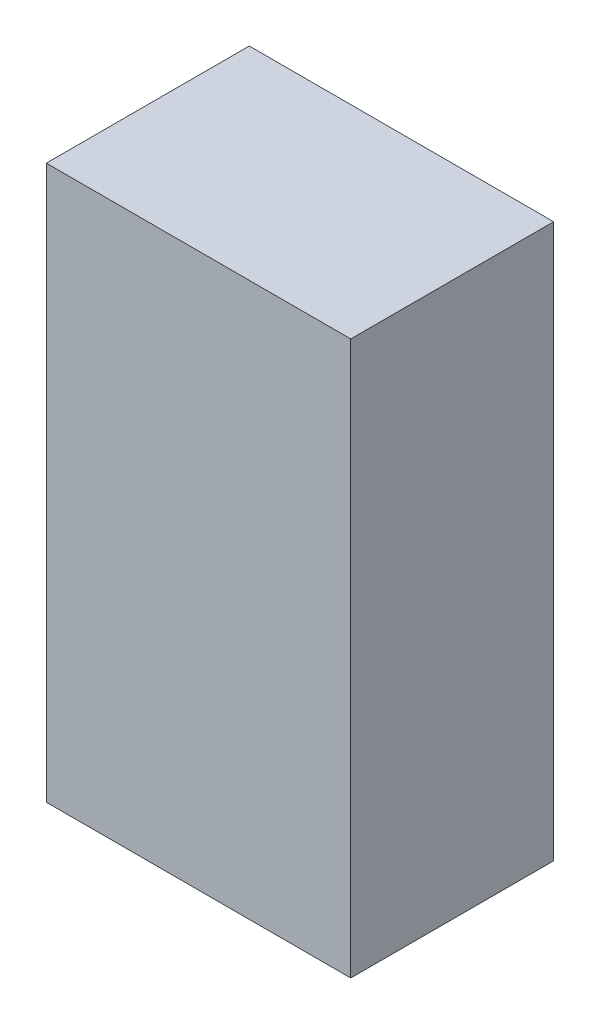
ISO-10303-21;
HEADER;
FILE_DESCRIPTION(('STEP AP214'),'2;1');
FILE_NAME('part.step','',(''),(''),'','','');
FILE_SCHEMA(('AUTOMOTIVE_DESIGN { 1 0 10303 214 1 1 1 1 }'));
ENDSEC;
DATA;
#1=APPLICATION_CONTEXT('core data for automotive mechanical design processes');
#2=APPLICATION_PROTOCOL_DEFINITION('international standard','automotive_design',2000,#1);
#3=PRODUCT_CONTEXT('',#1,'mechanical');
#4=PRODUCT('Part','Part','',(#3));
#5=PRODUCT_RELATED_PRODUCT_CATEGORY('part','',(#4));
#6=PRODUCT_DEFINITION_FORMATION('','',#4);
#7=PRODUCT_DEFINITION_CONTEXT('part definition',#1,'design');
#8=PRODUCT_DEFINITION('design','',#6,#7);
#9=PRODUCT_DEFINITION_SHAPE('','',#8);
#10=(LENGTH_UNIT() NAMED_UNIT(*) SI_UNIT(.MILLI.,.METRE.));
#11=(NAMED_UNIT(*) PLANE_ANGLE_UNIT() SI_UNIT($,.RADIAN.));
#12=(NAMED_UNIT(*) SI_UNIT($,.STERADIAN.) SOLID_ANGLE_UNIT());
#13=UNCERTAINTY_MEASURE_WITH_UNIT(LENGTH_MEASURE(1.E-05),#10,'distance_accuracy_value','');
#14=(GEOMETRIC_REPRESENTATION_CONTEXT(3) GLOBAL_UNCERTAINTY_ASSIGNED_CONTEXT((#13)) GLOBAL_UNIT_ASSIGNED_CONTEXT((#10,
#11,#12)) REPRESENTATION_CONTEXT('',''));
#15=CARTESIAN_POINT('',(0.,0.,0.));
#16=DIRECTION('',(0.,0.,1.));
#17=DIRECTION('',(1.,0.,0.));
#18=AXIS2_PLACEMENT_3D('',#15,#16,#17);
#19=CARTESIAN_POINT('',(-0.82499962,1.49999954,1.10000034));
#20=DIRECTION('',(0.,0.,-1.));
#21=DIRECTION('',(-1.,0.,0.));
#22=AXIS2_PLACEMENT_3D('',#19,#20,#21);
#23=PLANE('',#22);
#24=DIRECTION('',(1.,0.,0.));
#25=VECTOR('',#24,1.);
#26=CARTESIAN_POINT('',(-0.82499962,-1.49999954,1.10000034));
#27=LINE('',#26,#25);
#28=CARTESIAN_POINT('',(-0.82499962,-1.49999954,1.10000034));
#29=VERTEX_POINT('',#28);
#30=CARTESIAN_POINT('',(0.82499962,-1.49999954,1.10000034));
#31=VERTEX_POINT('',#30);
#32=EDGE_CURVE('E55',#29,#31,#27,.T.);
#33=ORIENTED_EDGE('',*,*,#32,.T.);
#34=DIRECTION('',(0.,1.,0.));
#35=VECTOR('',#34,1.);
#36=CARTESIAN_POINT('',(0.82499962,-1.49999954,1.10000034));
#37=LINE('',#36,#35);
#38=CARTESIAN_POINT('',(0.82499962,1.49999954,1.10000034));
#39=VERTEX_POINT('',#38);
#40=EDGE_CURVE('E57',#31,#39,#37,.T.);
#41=ORIENTED_EDGE('',*,*,#40,.T.);
#42=DIRECTION('',(1.,0.,0.));
#43=VECTOR('',#42,1.);
#44=CARTESIAN_POINT('',(0.82499962,1.49999954,1.10000034));
#45=LINE('',#44,#43);
#46=CARTESIAN_POINT('',(-0.82499962,1.49999954,1.10000034));
#47=VERTEX_POINT('',#46);
#48=EDGE_CURVE('E20',#39,#47,#45,.F.);
#49=ORIENTED_EDGE('',*,*,#48,.T.);
#50=DIRECTION('',(0.,1.,0.));
#51=VECTOR('',#50,1.);
#52=CARTESIAN_POINT('',(-0.82499962,1.49999954,1.10000034));
#53=LINE('',#52,#51);
#54=EDGE_CURVE('E80',#47,#29,#53,.F.);
#55=ORIENTED_EDGE('',*,*,#54,.T.);
#56=EDGE_LOOP('',(#33,#41,#49,#55));
#57=FACE_BOUND('',#56,.T.);
#58=ADVANCED_FACE('F17',(#57),#23,.F.);
#59=CARTESIAN_POINT('',(0.82499962,1.49999954,0.));
#60=DIRECTION('',(0.,-1.,0.));
#61=DIRECTION('',(0.,0.,-1.));
#62=AXIS2_PLACEMENT_3D('',#59,#60,#61);
#63=PLANE('',#62);
#64=DIRECTION('',(0.,0.,-1.));
#65=VECTOR('',#64,1.);
#66=CARTESIAN_POINT('',(-0.82499962,1.49999954,0.));
#67=LINE('',#66,#65);
#68=CARTESIAN_POINT('',(-0.82499962,1.49999954,0.));
#69=VERTEX_POINT('',#68);
#70=EDGE_CURVE('E68',#69,#47,#67,.F.);
#71=ORIENTED_EDGE('',*,*,#70,.T.);
#72=ORIENTED_EDGE('',*,*,#48,.F.);
#73=DIRECTION('',(0.,0.,1.));
#74=VECTOR('',#73,1.);
#75=CARTESIAN_POINT('',(0.82499962,1.49999954,0.));
#76=LINE('',#75,#74);
#77=CARTESIAN_POINT('',(0.82499962,1.49999954,0.));
#78=VERTEX_POINT('',#77);
#79=EDGE_CURVE('E63',#39,#78,#76,.F.);
#80=ORIENTED_EDGE('',*,*,#79,.T.);
#81=DIRECTION('',(-1.,0.,0.));
#82=VECTOR('',#81,1.);
#83=CARTESIAN_POINT('',(-0.82499962,1.49999954,0.));
#84=LINE('',#83,#82);
#85=EDGE_CURVE('E83',#69,#78,#84,.F.);
#86=ORIENTED_EDGE('',*,*,#85,.F.);
#87=EDGE_LOOP('',(#71,#72,#80,#86));
#88=FACE_BOUND('',#87,.T.);
#89=ADVANCED_FACE('F65',(#88),#63,.F.);
#90=CARTESIAN_POINT('',(0.82499962,-1.49999954,0.));
#91=DIRECTION('',(-1.,0.,0.));
#92=DIRECTION('',(0.,0.,1.));
#93=AXIS2_PLACEMENT_3D('',#90,#91,#92);
#94=PLANE('',#93);
#95=ORIENTED_EDGE('',*,*,#79,.F.);
#96=ORIENTED_EDGE('',*,*,#40,.F.);
#97=DIRECTION('',(0.,0.,1.));
#98=VECTOR('',#97,1.);
#99=CARTESIAN_POINT('',(0.82499962,-1.49999954,0.));
#100=LINE('',#99,#98);
#101=CARTESIAN_POINT('',(0.82499962,-1.49999954,0.));
#102=VERTEX_POINT('',#101);
#103=EDGE_CURVE('E75',#31,#102,#100,.F.);
#104=ORIENTED_EDGE('',*,*,#103,.T.);
#105=DIRECTION('',(0.,1.,0.));
#106=VECTOR('',#105,1.);
#107=CARTESIAN_POINT('',(0.82499962,1.49999954,0.));
#108=LINE('',#107,#106);
#109=EDGE_CURVE('E72',#78,#102,#108,.F.);
#110=ORIENTED_EDGE('',*,*,#109,.F.);
#111=EDGE_LOOP('',(#95,#96,#104,#110));
#112=FACE_BOUND('',#111,.T.);
#113=ADVANCED_FACE('F70',(#112),#94,.F.);
#114=CARTESIAN_POINT('',(-0.82499962,-1.49999954,0.));
#115=DIRECTION('',(0.,1.,0.));
#116=DIRECTION('',(0.,0.,1.));
#117=AXIS2_PLACEMENT_3D('',#114,#115,#116);
#118=PLANE('',#117);
#119=ORIENTED_EDGE('',*,*,#103,.F.);
#120=ORIENTED_EDGE('',*,*,#32,.F.);
#121=DIRECTION('',(0.,0.,-1.));
#122=VECTOR('',#121,1.);
#123=CARTESIAN_POINT('',(-0.82499962,-1.49999954,0.));
#124=LINE('',#123,#122);
#125=CARTESIAN_POINT('',(-0.82499962,-1.49999954,0.));
#126=VERTEX_POINT('',#125);
#127=EDGE_CURVE('E35',#29,#126,#124,.T.);
#128=ORIENTED_EDGE('',*,*,#127,.T.);
#129=DIRECTION('',(-1.,0.,0.));
#130=VECTOR('',#129,1.);
#131=CARTESIAN_POINT('',(-0.82499962,-1.49999954,0.));
#132=LINE('',#131,#130);
#133=EDGE_CURVE('E26',#102,#126,#132,.T.);
#134=ORIENTED_EDGE('',*,*,#133,.F.);
#135=EDGE_LOOP('',(#119,#120,#128,#134));
#136=FACE_BOUND('',#135,.T.);
#137=ADVANCED_FACE('F89',(#136),#118,.F.);
#138=CARTESIAN_POINT('',(-0.82499962,1.49999954,0.));
#139=DIRECTION('',(1.,0.,0.));
#140=DIRECTION('',(0.,0.,-1.));
#141=AXIS2_PLACEMENT_3D('',#138,#139,#140);
#142=PLANE('',#141);
#143=ORIENTED_EDGE('',*,*,#127,.F.);
#144=ORIENTED_EDGE('',*,*,#54,.F.);
#145=ORIENTED_EDGE('',*,*,#70,.F.);
#146=DIRECTION('',(0.,1.,0.));
#147=VECTOR('',#146,1.);
#148=CARTESIAN_POINT('',(-0.82499962,1.49999954,0.));
#149=LINE('',#148,#147);
#150=EDGE_CURVE('E11',#126,#69,#149,.T.);
#151=ORIENTED_EDGE('',*,*,#150,.F.);
#152=EDGE_LOOP('',(#143,#144,#145,#151));
#153=FACE_BOUND('',#152,.T.);
#154=ADVANCED_FACE('F91',(#153),#142,.F.);
#155=CARTESIAN_POINT('',(-0.82499962,1.49999954,0.));
#156=DIRECTION('',(0.,0.,-1.));
#157=DIRECTION('',(-1.,0.,0.));
#158=AXIS2_PLACEMENT_3D('',#155,#156,#157);
#159=PLANE('',#158);
#160=ORIENTED_EDGE('',*,*,#133,.T.);
#161=ORIENTED_EDGE('',*,*,#150,.T.);
#162=ORIENTED_EDGE('',*,*,#85,.T.);
#163=ORIENTED_EDGE('',*,*,#109,.T.);
#164=EDGE_LOOP('',(#160,#161,#162,#163));
#165=FACE_BOUND('',#164,.T.);
#166=ADVANCED_FACE('F88',(#165),#159,.T.);
#167=CLOSED_SHELL('',(#58,#89,#113,#137,#154,#166));
#168=MANIFOLD_SOLID_BREP('B1',#167);
#169=ADVANCED_BREP_SHAPE_REPRESENTATION('',(#18,#168),#14);
#170=SHAPE_DEFINITION_REPRESENTATION(#9,#169);
ENDSEC;
END-ISO-10303-21;
